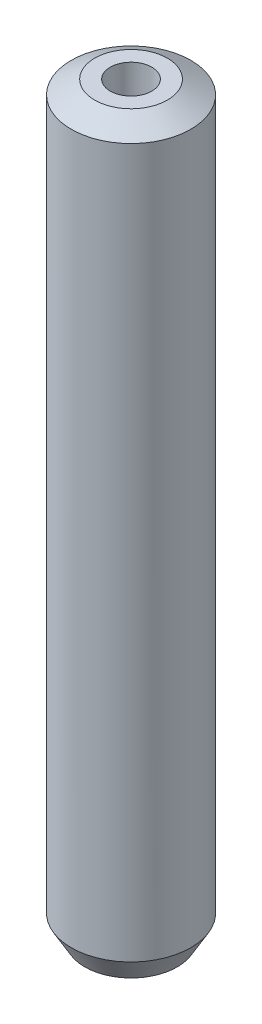
ISO-10303-21;
HEADER;
FILE_DESCRIPTION(('STEP AP214'),'2;1');
FILE_NAME('part.step','',(''),(''),'','','');
FILE_SCHEMA(('AUTOMOTIVE_DESIGN { 1 0 10303 214 1 1 1 1 }'));
ENDSEC;
DATA;
#1=APPLICATION_CONTEXT('core data for automotive mechanical design processes');
#2=APPLICATION_PROTOCOL_DEFINITION('international standard','automotive_design',2000,#1);
#3=PRODUCT_CONTEXT('',#1,'mechanical');
#4=PRODUCT('Part','Part','',(#3));
#5=PRODUCT_RELATED_PRODUCT_CATEGORY('part','',(#4));
#6=PRODUCT_DEFINITION_FORMATION('','',#4);
#7=PRODUCT_DEFINITION_CONTEXT('part definition',#1,'design');
#8=PRODUCT_DEFINITION('design','',#6,#7);
#9=PRODUCT_DEFINITION_SHAPE('','',#8);
#10=(LENGTH_UNIT() NAMED_UNIT(*) SI_UNIT(.MILLI.,.METRE.));
#11=(NAMED_UNIT(*) PLANE_ANGLE_UNIT() SI_UNIT($,.RADIAN.));
#12=(NAMED_UNIT(*) SI_UNIT($,.STERADIAN.) SOLID_ANGLE_UNIT());
#13=UNCERTAINTY_MEASURE_WITH_UNIT(LENGTH_MEASURE(1.E-05),#10,'distance_accuracy_value','');
#14=(GEOMETRIC_REPRESENTATION_CONTEXT(3) GLOBAL_UNCERTAINTY_ASSIGNED_CONTEXT((#13)) GLOBAL_UNIT_ASSIGNED_CONTEXT((#10,
#11,#12)) REPRESENTATION_CONTEXT('',''));
#15=CARTESIAN_POINT('',(0.,0.,0.));
#16=DIRECTION('',(0.,0.,1.));
#17=DIRECTION('',(1.,0.,0.));
#18=AXIS2_PLACEMENT_3D('',#15,#16,#17);
#19=CARTESIAN_POINT('',(0.,93.5534795870899,0.));
#20=DIRECTION('',(0.,-1.,0.));
#21=DIRECTION('',(0.,0.,-1.));
#22=AXIS2_PLACEMENT_3D('',#19,#20,#21);
#23=CYLINDRICAL_SURFACE('',#22,7.5);
#24=CARTESIAN_POINT('',(0.,91.8553723555107,0.));
#25=DIRECTION('',(0.,1.,0.));
#26=DIRECTION('',(0.,0.,1.));
#27=AXIS2_PLACEMENT_3D('',#24,#25,#26);
#28=CIRCLE('',#27,7.5);
#29=CARTESIAN_POINT('',(0.,91.8553723555107,-7.50000000000001));
#30=VERTEX_POINT('',#29);
#31=EDGE_CURVE('E50',#30,#30,#28,.F.);
#32=ORIENTED_EDGE('',*,*,#31,.T.);
#33=EDGE_LOOP('',(#32));
#34=FACE_BOUND('',#33,.T.);
#35=CARTESIAN_POINT('',(0.,2.94120800179515,0.));
#36=DIRECTION('',(0.,1.,0.));
#37=DIRECTION('',(0.,0.,1.));
#38=AXIS2_PLACEMENT_3D('',#35,#36,#37);
#39=CIRCLE('',#38,7.5);
#40=CARTESIAN_POINT('',(0.,2.94120800179515,7.5));
#41=VERTEX_POINT('',#40);
#42=EDGE_CURVE('E51',#41,#41,#39,.T.);
#43=ORIENTED_EDGE('',*,*,#42,.T.);
#44=EDGE_LOOP('',(#43));
#45=FACE_BOUND('',#44,.T.);
#46=ADVANCED_FACE('F39',(#34,#45),#23,.T.);
#47=CARTESIAN_POINT('',(0.,93.5534795870899,0.));
#48=DIRECTION('',(0.,1.,0.));
#49=DIRECTION('',(0.,0.,1.));
#50=AXIS2_PLACEMENT_3D('',#47,#48,#49);
#51=PLANE('',#50);
#52=CARTESIAN_POINT('',(0.,93.5534795870899,0.));
#53=DIRECTION('',(0.,1.,0.));
#54=DIRECTION('',(0.,0.,1.));
#55=AXIS2_PLACEMENT_3D('',#52,#53,#54);
#56=CIRCLE('',#55,4.5587919982048);
#57=CARTESIAN_POINT('',(0.,93.5534795870899,-4.55879199820481));
#58=VERTEX_POINT('',#57);
#59=EDGE_CURVE('E54',#58,#58,#56,.T.);
#60=ORIENTED_EDGE('',*,*,#59,.T.);
#61=EDGE_LOOP('',(#60));
#62=FACE_BOUND('',#61,.T.);
#63=CARTESIAN_POINT('',(0.,93.5534795870899,0.));
#64=DIRECTION('',(0.,1.,0.));
#65=DIRECTION('',(0.,0.,1.));
#66=AXIS2_PLACEMENT_3D('',#63,#64,#65);
#67=CIRCLE('',#66,2.60652545215556);
#68=CARTESIAN_POINT('',(0.,93.5534795870899,2.60652545215556));
#69=VERTEX_POINT('',#68);
#70=EDGE_CURVE('E58',#69,#69,#67,.T.);
#71=ORIENTED_EDGE('',*,*,#70,.F.);
#72=EDGE_LOOP('',(#71));
#73=FACE_BOUND('',#72,.T.);
#74=ADVANCED_FACE('F69',(#62,#73),#51,.T.);
#75=CARTESIAN_POINT('',(0.,0.,0.));
#76=DIRECTION('',(0.,1.,0.));
#77=DIRECTION('',(0.,0.,1.));
#78=AXIS2_PLACEMENT_3D('',#75,#76,#77);
#79=PLANE('',#78);
#80=CARTESIAN_POINT('',(0.,0.,0.));
#81=DIRECTION('',(0.,1.,0.));
#82=DIRECTION('',(0.,0.,1.));
#83=AXIS2_PLACEMENT_3D('',#80,#81,#82);
#84=CIRCLE('',#83,5.80189276842087);
#85=CARTESIAN_POINT('',(0.,0.,5.80189276842087));
#86=VERTEX_POINT('',#85);
#87=EDGE_CURVE('E10',#86,#86,#84,.F.);
#88=ORIENTED_EDGE('',*,*,#87,.T.);
#89=EDGE_LOOP('',(#88));
#90=FACE_BOUND('',#89,.T.);
#91=CARTESIAN_POINT('',(0.,0.,0.));
#92=DIRECTION('',(0.,1.,0.));
#93=DIRECTION('',(0.,0.,1.));
#94=AXIS2_PLACEMENT_3D('',#91,#92,#93);
#95=CIRCLE('',#94,2.60652545215556);
#96=CARTESIAN_POINT('',(0.,0.,2.60652545215556));
#97=VERTEX_POINT('',#96);
#98=EDGE_CURVE('E63',#97,#97,#95,.T.);
#99=ORIENTED_EDGE('',*,*,#98,.T.);
#100=EDGE_LOOP('',(#99));
#101=FACE_BOUND('',#100,.T.);
#102=ADVANCED_FACE('F75',(#90,#101),#79,.F.);
#103=CARTESIAN_POINT('',(0.,93.5534795870899,0.));
#104=DIRECTION('',(0.,-1.,0.));
#105=DIRECTION('',(0.,0.,-1.));
#106=AXIS2_PLACEMENT_3D('',#103,#104,#105);
#107=CYLINDRICAL_SURFACE('',#106,2.60652545215556);
#108=ORIENTED_EDGE('',*,*,#70,.T.);
#109=EDGE_LOOP('',(#108));
#110=FACE_BOUND('',#109,.T.);
#111=ORIENTED_EDGE('',*,*,#98,.F.);
#112=EDGE_LOOP('',(#111));
#113=FACE_BOUND('',#112,.T.);
#114=ADVANCED_FACE('F70',(#110,#113),#107,.F.);
#115=CARTESIAN_POINT('',(0.,93.5534795870899,0.));
#116=DIRECTION('',(0.,-1.,0.));
#117=DIRECTION('',(0.,0.,-1.));
#118=AXIS2_PLACEMENT_3D('',#115,#116,#117);
#119=CONICAL_SURFACE('',#118,4.5587919982048,1.04719755119659);
#120=CARTESIAN_POINT('',(0.,91.8553723555107,-7.50000000000001));
#121=CARTESIAN_POINT('',(0.,91.8730609725064,-7.46936241664798));
#122=CARTESIAN_POINT('',(0.,91.890749589502,-7.43872483329594));
#123=CARTESIAN_POINT('',(0.,91.9261268234932,-7.37744966659188));
#124=CARTESIAN_POINT('',(0.,91.9438154404888,-7.34681208323985));
#125=CARTESIAN_POINT('',(0.,91.97919267448,-7.28553691653578));
#126=CARTESIAN_POINT('',(0.,91.9968812914757,-7.25489933318374));
#127=CARTESIAN_POINT('',(0.,92.0322585254669,-7.19362416647968));
#128=CARTESIAN_POINT('',(0.,92.0499471424625,-7.16298658312765));
#129=CARTESIAN_POINT('',(0.,92.0853243764537,-7.10171141642358));
#130=CARTESIAN_POINT('',(0.,92.1030129934494,-7.07107383307154));
#131=CARTESIAN_POINT('',(0.,92.1383902274406,-7.00979866636748));
#132=CARTESIAN_POINT('',(0.,92.1560788444362,-6.97916108301545));
#133=CARTESIAN_POINT('',(0.,92.1914560784274,-6.91788591631138));
#134=CARTESIAN_POINT('',(0.,92.2091446954231,-6.88724833295934));
#135=CARTESIAN_POINT('',(0.,92.2445219294143,-6.82597316625528));
#136=CARTESIAN_POINT('',(0.,92.2622105464099,-6.79533558290325));
#137=CARTESIAN_POINT('',(0.,92.2975877804011,-6.73406041619918));
#138=CARTESIAN_POINT('',(0.,92.3152763973968,-6.70342283284714));
#139=CARTESIAN_POINT('',(0.,92.350653631388,-6.64214766614308));
#140=CARTESIAN_POINT('',(0.,92.3683422483836,-6.61151008279105));
#141=CARTESIAN_POINT('',(0.,92.4037194823748,-6.55023491608698));
#142=CARTESIAN_POINT('',(0.,92.4214080993705,-6.51959733273494));
#143=CARTESIAN_POINT('',(0.,92.4567853333617,-6.45832216603088));
#144=CARTESIAN_POINT('',(0.,92.4744739503573,-6.42768458267885));
#145=CARTESIAN_POINT('',(0.,92.5098511843485,-6.36640941597478));
#146=CARTESIAN_POINT('',(0.,92.5275398013441,-6.33577183262274));
#147=CARTESIAN_POINT('',(0.,92.5629170353354,-6.27449666591868));
#148=CARTESIAN_POINT('',(0.,92.580605652331,-6.24385908256665));
#149=CARTESIAN_POINT('',(0.,92.6159828863222,-6.18258391586258));
#150=CARTESIAN_POINT('',(0.,92.6336715033178,-6.15194633251055));
#151=CARTESIAN_POINT('',(0.,92.6690487373091,-6.09067116580648));
#152=CARTESIAN_POINT('',(0.,92.6867373543047,-6.06003358245445));
#153=CARTESIAN_POINT('',(0.,92.7221145882959,-5.99875841575038));
#154=CARTESIAN_POINT('',(0.,92.7398032052915,-5.96812083239835));
#155=CARTESIAN_POINT('',(0.,92.7751804392828,-5.90684566569428));
#156=CARTESIAN_POINT('',(0.,92.7928690562784,-5.87620808234225));
#157=CARTESIAN_POINT('',(0.,92.8282462902696,-5.81493291563818));
#158=CARTESIAN_POINT('',(0.,92.8459349072652,-5.78429533228615));
#159=CARTESIAN_POINT('',(0.,92.8813121412565,-5.72302016558208));
#160=CARTESIAN_POINT('',(0.,92.8990007582521,-5.69238258223005));
#161=CARTESIAN_POINT('',(0.,92.9343779922433,-5.63110741552598));
#162=CARTESIAN_POINT('',(0.,92.9520666092389,-5.60046983217395));
#163=CARTESIAN_POINT('',(0.,92.9874438432302,-5.53919466546988));
#164=CARTESIAN_POINT('',(0.,93.0051324602258,-5.50855708211785));
#165=CARTESIAN_POINT('',(0.,93.040509694217,-5.44728191541378));
#166=CARTESIAN_POINT('',(0.,93.0581983112126,-5.41664433206175));
#167=CARTESIAN_POINT('',(0.,93.0935755452039,-5.35536916535768));
#168=CARTESIAN_POINT('',(0.,93.1112641621995,-5.32473158200565));
#169=CARTESIAN_POINT('',(0.,93.1466413961907,-5.26345641530158));
#170=CARTESIAN_POINT('',(0.,93.1643300131863,-5.23281883194955));
#171=CARTESIAN_POINT('',(0.,93.1997072471776,-5.17154366524548));
#172=CARTESIAN_POINT('',(0.,93.2173958641732,-5.14090608189345));
#173=CARTESIAN_POINT('',(0.,93.2527730981644,-5.07963091518938));
#174=CARTESIAN_POINT('',(0.,93.27046171516,-5.04899333183735));
#175=CARTESIAN_POINT('',(0.,93.3058389491513,-4.98771816513328));
#176=CARTESIAN_POINT('',(0.,93.3235275661469,-4.95708058178125));
#177=CARTESIAN_POINT('',(0.,93.3589048001381,-4.89580541507718));
#178=CARTESIAN_POINT('',(0.,93.3765934171337,-4.86516783172515));
#179=CARTESIAN_POINT('',(0.,93.411970651125,-4.80389266502108));
#180=CARTESIAN_POINT('',(0.,93.4296592681206,-4.77325508166905));
#181=CARTESIAN_POINT('',(0.,93.4650365021118,-4.71197991496498));
#182=CARTESIAN_POINT('',(0.,93.4827251191074,-4.68134233161295));
#183=CARTESIAN_POINT('',(0.,93.5181023530986,-4.62006716490888));
#184=CARTESIAN_POINT('',(0.,93.5357909700943,-4.58942958155684));
#185=CARTESIAN_POINT('',(0.,93.5534795870899,-4.55879199820481));
#186=B_SPLINE_CURVE_WITH_KNOTS('',3,(#120,#121,#122,#123,#124,#125,#126,#127,#128,#129,#130,
#131,#132,#133,#134,#135,#136,#137,#138,#139,#140,#141,#142,#143,#144,#145,#146,#147,#148,#149,
#150,#151,#152,#153,#154,#155,#156,#157,#158,#159,#160,#161,#162,#163,#164,#165,#166,#167,#168,
#169,#170,#171,#172,#173,#174,#175,#176,#177,#178,#179,#180,#181,#182,#183,#184,#185),
.UNSPECIFIED.,.F.,.F.,(4,2,2,2,2,2,2,2,2,2,2,2,2,2,2,2,2,2,2,2,2,2,2,2,2,2,2,2,2,2,2,2,4),(0.,
0.106131701973693,0.212263403947393,0.318395105921086,0.424526807894786,0.530658509868479,
0.636790211842178,0.742921913815871,0.84905361578957,0.955185317763263,1.06131701973696,
1.16744872171066,1.27358042368436,1.37971212565805,1.48584382763175,1.59197552960544,
1.69810723157914,1.80423893355283,1.91037063552653,2.01650233750023,2.12263403947393,
2.22876574144762,2.33489744342132,2.44102914539501,2.54716084736871,2.6532925493424,
2.7594242513161,2.8655559532898,2.9716876552635,3.07781935723719,3.18395105921089,
3.29008276118458,3.39621446315828),.UNSPECIFIED.);
#187=EDGE_CURVE('BSEAM81',#30,#58,#186,.T.);
#188=ORIENTED_EDGE('',*,*,#31,.F.);
#189=ORIENTED_EDGE('',*,*,#59,.F.);
#190=ORIENTED_EDGE('',*,*,#187,.T.);
#191=ORIENTED_EDGE('',*,*,#187,.F.);
#192=EDGE_LOOP('',(#188,#190,#189,#191));
#193=FACE_BOUND('',#192,.T.);
#194=ADVANCED_FACE('F81',(#193),#119,.T.);
#195=CARTESIAN_POINT('',(0.,2.94120800179515,0.));
#196=DIRECTION('',(0.,1.,0.));
#197=DIRECTION('',(0.,0.,1.));
#198=AXIS2_PLACEMENT_3D('',#195,#196,#197);
#199=CONICAL_SURFACE('',#198,7.5,0.523598775598303);
#200=ORIENTED_EDGE('',*,*,#87,.F.);
#201=EDGE_LOOP('',(#200));
#202=FACE_BOUND('',#201,.T.);
#203=ORIENTED_EDGE('',*,*,#42,.F.);
#204=EDGE_LOOP('',(#203));
#205=FACE_BOUND('',#204,.T.);
#206=ADVANCED_FACE('F45',(#202,#205),#199,.T.);
#207=CLOSED_SHELL('',(#46,#74,#102,#114,#194,#206));
#208=MANIFOLD_SOLID_BREP('B2',#207);
#209=ADVANCED_BREP_SHAPE_REPRESENTATION('',(#18,#208),#14);
#210=SHAPE_DEFINITION_REPRESENTATION(#9,#209);
ENDSEC;
END-ISO-10303-21;
